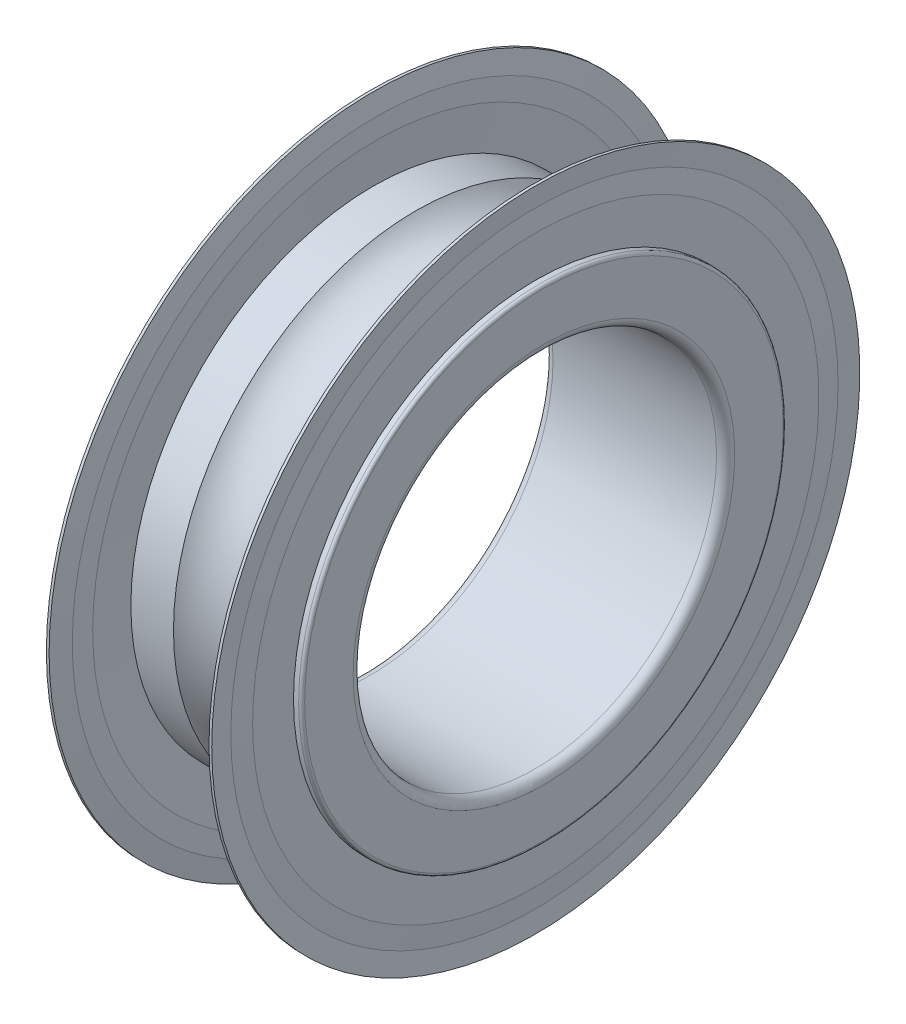
ISO-10303-21;
HEADER;
FILE_DESCRIPTION(('STEP AP214'),'2;1');
FILE_NAME('part.step','',(''),(''),'','','');
FILE_SCHEMA(('AUTOMOTIVE_DESIGN { 1 0 10303 214 1 1 1 1 }'));
ENDSEC;
DATA;
#1=APPLICATION_CONTEXT('core data for automotive mechanical design processes');
#2=APPLICATION_PROTOCOL_DEFINITION('international standard','automotive_design',2000,#1);
#3=PRODUCT_CONTEXT('',#1,'mechanical');
#4=PRODUCT('Part','Part','',(#3));
#5=PRODUCT_RELATED_PRODUCT_CATEGORY('part','',(#4));
#6=PRODUCT_DEFINITION_FORMATION('','',#4);
#7=PRODUCT_DEFINITION_CONTEXT('part definition',#1,'design');
#8=PRODUCT_DEFINITION('design','',#6,#7);
#9=PRODUCT_DEFINITION_SHAPE('','',#8);
#10=(LENGTH_UNIT() NAMED_UNIT(*) SI_UNIT(.MILLI.,.METRE.));
#11=(NAMED_UNIT(*) PLANE_ANGLE_UNIT() SI_UNIT($,.RADIAN.));
#12=(NAMED_UNIT(*) SI_UNIT($,.STERADIAN.) SOLID_ANGLE_UNIT());
#13=UNCERTAINTY_MEASURE_WITH_UNIT(LENGTH_MEASURE(1.E-05),#10,'distance_accuracy_value','');
#14=(GEOMETRIC_REPRESENTATION_CONTEXT(3) GLOBAL_UNCERTAINTY_ASSIGNED_CONTEXT((#13)) GLOBAL_UNIT_ASSIGNED_CONTEXT((#10,
#11,#12)) REPRESENTATION_CONTEXT('',''));
#15=CARTESIAN_POINT('',(0.,0.,0.));
#16=DIRECTION('',(0.,0.,1.));
#17=DIRECTION('',(1.,0.,0.));
#18=AXIS2_PLACEMENT_3D('',#15,#16,#17);
#19=CARTESIAN_POINT('',(50.,0.,0.));
#20=DIRECTION('',(-1.,0.,0.));
#21=DIRECTION('',(0.,0.,1.));
#22=AXIS2_PLACEMENT_3D('',#19,#20,#21);
#23=CYLINDRICAL_SURFACE('',#22,8.);
#24=CARTESIAN_POINT('',(4.232946166708,0.,0.));
#25=DIRECTION('',(-1.,0.,0.));
#26=DIRECTION('',(0.,0.,1.));
#27=AXIS2_PLACEMENT_3D('',#24,#25,#26);
#28=CIRCLE('',#27,8.);
#29=CARTESIAN_POINT('',(4.232946166708,0.,8.));
#30=VERTEX_POINT('',#29);
#31=EDGE_CURVE('E72',#30,#30,#28,.T.);
#32=ORIENTED_EDGE('',*,*,#31,.F.);
#33=EDGE_LOOP('',(#32));
#34=FACE_BOUND('',#33,.T.);
#35=CARTESIAN_POINT('',(5.64,0.,0.));
#36=DIRECTION('',(-1.,0.,0.));
#37=DIRECTION('',(0.,0.,1.));
#38=AXIS2_PLACEMENT_3D('',#35,#36,#37);
#39=CIRCLE('',#38,8.);
#40=CARTESIAN_POINT('',(5.64,0.,8.));
#41=VERTEX_POINT('',#40);
#42=EDGE_CURVE('E10',#41,#41,#39,.F.);
#43=ORIENTED_EDGE('',*,*,#42,.F.);
#44=EDGE_LOOP('',(#43));
#45=FACE_BOUND('',#44,.T.);
#46=ADVANCED_FACE('F31',(#34,#45),#23,.T.);
#47=CARTESIAN_POINT('',(5.9,0.,0.));
#48=DIRECTION('',(-1.,0.,0.));
#49=DIRECTION('',(0.,0.,1.));
#50=AXIS2_PLACEMENT_3D('',#47,#48,#49);
#51=CIRCLE('',#50,8.);
#52=CARTESIAN_POINT('',(5.9,0.,8.));
#53=VERTEX_POINT('',#52);
#54=EDGE_CURVE('E69',#53,#53,#51,.T.);
#55=ORIENTED_EDGE('',*,*,#54,.T.);
#56=EDGE_LOOP('',(#55));
#57=FACE_BOUND('',#56,.T.);
#58=CARTESIAN_POINT('',(5.73,0.,0.));
#59=DIRECTION('',(-1.,0.,0.));
#60=DIRECTION('',(0.,0.,1.));
#61=AXIS2_PLACEMENT_3D('',#58,#59,#60);
#62=CIRCLE('',#61,8.);
#63=CARTESIAN_POINT('',(5.73,0.,8.));
#64=VERTEX_POINT('',#63);
#65=EDGE_CURVE('E38',#64,#64,#62,.T.);
#66=ORIENTED_EDGE('',*,*,#65,.F.);
#67=EDGE_LOOP('',(#66));
#68=FACE_BOUND('',#67,.T.);
#69=ADVANCED_FACE('F148',(#57,#68),#23,.T.);
#70=CARTESIAN_POINT('',(50.,0.,0.));
#71=DIRECTION('',(-1.,0.,0.));
#72=DIRECTION('',(0.,0.,1.));
#73=AXIS2_PLACEMENT_3D('',#70,#71,#72);
#74=CYLINDRICAL_SURFACE('',#73,8.);
#75=CARTESIAN_POINT('',(0.100000000000003,0.,0.));
#76=DIRECTION('',(-1.,0.,0.));
#77=DIRECTION('',(0.,0.,1.));
#78=AXIS2_PLACEMENT_3D('',#75,#76,#77);
#79=CIRCLE('',#78,8.);
#80=CARTESIAN_POINT('',(0.100000000000003,0.,8.));
#81=VERTEX_POINT('',#80);
#82=EDGE_CURVE('E78',#81,#81,#79,.T.);
#83=ORIENTED_EDGE('',*,*,#82,.F.);
#84=EDGE_LOOP('',(#83));
#85=FACE_BOUND('',#84,.T.);
#86=CARTESIAN_POINT('',(0.269999999999999,0.,0.));
#87=DIRECTION('',(1.,0.,0.));
#88=DIRECTION('',(0.,0.,-1.));
#89=AXIS2_PLACEMENT_3D('',#86,#87,#88);
#90=CIRCLE('',#89,8.);
#91=CARTESIAN_POINT('',(0.269999999999999,0.,-8.));
#92=VERTEX_POINT('',#91);
#93=EDGE_CURVE('E42',#92,#92,#90,.T.);
#94=ORIENTED_EDGE('',*,*,#93,.F.);
#95=EDGE_LOOP('',(#94));
#96=FACE_BOUND('',#95,.T.);
#97=ADVANCED_FACE('F154',(#85,#96),#74,.T.);
#98=CARTESIAN_POINT('',(1.767053833292,0.,0.));
#99=DIRECTION('',(-1.,0.,0.));
#100=DIRECTION('',(0.,0.,1.));
#101=AXIS2_PLACEMENT_3D('',#98,#99,#100);
#102=CIRCLE('',#101,8.);
#103=CARTESIAN_POINT('',(1.767053833292,0.,8.));
#104=VERTEX_POINT('',#103);
#105=EDGE_CURVE('E75',#104,#104,#102,.T.);
#106=ORIENTED_EDGE('',*,*,#105,.T.);
#107=EDGE_LOOP('',(#106));
#108=FACE_BOUND('',#107,.T.);
#109=CARTESIAN_POINT('',(0.359999999999999,0.,0.));
#110=DIRECTION('',(1.,0.,0.));
#111=DIRECTION('',(0.,0.,-1.));
#112=AXIS2_PLACEMENT_3D('',#109,#110,#111);
#113=CIRCLE('',#112,8.);
#114=CARTESIAN_POINT('',(0.359999999999999,0.,-8.));
#115=VERTEX_POINT('',#114);
#116=EDGE_CURVE('E46',#115,#115,#113,.F.);
#117=ORIENTED_EDGE('',*,*,#116,.F.);
#118=EDGE_LOOP('',(#117));
#119=FACE_BOUND('',#118,.T.);
#120=ADVANCED_FACE('F187',(#108,#119),#74,.T.);
#121=CARTESIAN_POINT('',(0.0999999999999205,0.,0.));
#122=DIRECTION('',(-1.,0.,0.));
#123=DIRECTION('',(0.,0.,1.));
#124=AXIS2_PLACEMENT_3D('',#121,#122,#123);
#125=TOROIDAL_SURFACE('',#124,7.90000000000008,0.0999999999999201);
#126=CARTESIAN_POINT('',(0.,0.,0.));
#127=DIRECTION('',(-1.,0.,0.));
#128=DIRECTION('',(0.,0.,1.));
#129=AXIS2_PLACEMENT_3D('',#126,#127,#128);
#130=CIRCLE('',#129,7.9);
#131=CARTESIAN_POINT('',(0.,0.,7.9));
#132=VERTEX_POINT('',#131);
#133=EDGE_CURVE('E51',#132,#132,#130,.T.);
#134=ORIENTED_EDGE('',*,*,#133,.F.);
#135=EDGE_LOOP('',(#134));
#136=FACE_BOUND('',#135,.T.);
#137=ORIENTED_EDGE('',*,*,#82,.T.);
#138=EDGE_LOOP('',(#137));
#139=FACE_BOUND('',#138,.T.);
#140=ADVANCED_FACE('F33',(#136,#139),#125,.T.);
#141=CARTESIAN_POINT('',(0.,7.9,0.));
#142=DIRECTION('',(1.,0.,0.));
#143=DIRECTION('',(0.,0.,-1.));
#144=AXIS2_PLACEMENT_3D('',#141,#142,#143);
#145=PLANE('',#144);
#146=CARTESIAN_POINT('',(0.,0.,0.));
#147=DIRECTION('',(-1.,0.,0.));
#148=DIRECTION('',(0.,0.,1.));
#149=AXIS2_PLACEMENT_3D('',#146,#147,#148);
#150=CIRCLE('',#149,6.3);
#151=CARTESIAN_POINT('',(0.,0.,6.3));
#152=VERTEX_POINT('',#151);
#153=EDGE_CURVE('E54',#152,#152,#150,.T.);
#154=ORIENTED_EDGE('',*,*,#153,.F.);
#155=EDGE_LOOP('',(#154));
#156=FACE_BOUND('',#155,.T.);
#157=ORIENTED_EDGE('',*,*,#133,.T.);
#158=EDGE_LOOP('',(#157));
#159=FACE_BOUND('',#158,.T.);
#160=ADVANCED_FACE('F180',(#156,#159),#145,.F.);
#161=CARTESIAN_POINT('',(0.299999999999939,0.,0.));
#162=DIRECTION('',(-1.,0.,0.));
#163=DIRECTION('',(0.,0.,1.));
#164=AXIS2_PLACEMENT_3D('',#161,#162,#163);
#165=TOROIDAL_SURFACE('',#164,6.29999999999994,0.299999999999939);
#166=CARTESIAN_POINT('',(0.300000000000002,0.,0.));
#167=DIRECTION('',(-1.,0.,0.));
#168=DIRECTION('',(0.,0.,1.));
#169=AXIS2_PLACEMENT_3D('',#166,#167,#168);
#170=CIRCLE('',#169,6.);
#171=CARTESIAN_POINT('',(0.300000000000002,0.,6.));
#172=VERTEX_POINT('',#171);
#173=EDGE_CURVE('E57',#172,#172,#170,.T.);
#174=ORIENTED_EDGE('',*,*,#173,.F.);
#175=EDGE_LOOP('',(#174));
#176=FACE_BOUND('',#175,.T.);
#177=ORIENTED_EDGE('',*,*,#153,.T.);
#178=EDGE_LOOP('',(#177));
#179=FACE_BOUND('',#178,.T.);
#180=ADVANCED_FACE('F177',(#176,#179),#165,.T.);
#181=CARTESIAN_POINT('',(50.,0.,0.));
#182=DIRECTION('',(-1.,0.,0.));
#183=DIRECTION('',(0.,0.,1.));
#184=AXIS2_PLACEMENT_3D('',#181,#182,#183);
#185=CYLINDRICAL_SURFACE('',#184,6.);
#186=CARTESIAN_POINT('',(5.7,0.,0.));
#187=DIRECTION('',(-1.,0.,0.));
#188=DIRECTION('',(0.,0.,1.));
#189=AXIS2_PLACEMENT_3D('',#186,#187,#188);
#190=CIRCLE('',#189,6.);
#191=CARTESIAN_POINT('',(5.7,0.,6.));
#192=VERTEX_POINT('',#191);
#193=EDGE_CURVE('E60',#192,#192,#190,.T.);
#194=ORIENTED_EDGE('',*,*,#193,.F.);
#195=EDGE_LOOP('',(#194));
#196=FACE_BOUND('',#195,.T.);
#197=ORIENTED_EDGE('',*,*,#173,.T.);
#198=EDGE_LOOP('',(#197));
#199=FACE_BOUND('',#198,.T.);
#200=ADVANCED_FACE('F173',(#196,#199),#185,.F.);
#201=CARTESIAN_POINT('',(5.70000000000012,0.,0.));
#202=DIRECTION('',(-1.,0.,0.));
#203=DIRECTION('',(0.,0.,1.));
#204=AXIS2_PLACEMENT_3D('',#201,#202,#203);
#205=TOROIDAL_SURFACE('',#204,6.29999999999988,0.299999999999877);
#206=CARTESIAN_POINT('',(6.,0.,0.));
#207=DIRECTION('',(-1.,0.,0.));
#208=DIRECTION('',(0.,0.,1.));
#209=AXIS2_PLACEMENT_3D('',#206,#207,#208);
#210=CIRCLE('',#209,6.3);
#211=CARTESIAN_POINT('',(6.,0.,6.3));
#212=VERTEX_POINT('',#211);
#213=EDGE_CURVE('E63',#212,#212,#210,.T.);
#214=ORIENTED_EDGE('',*,*,#213,.F.);
#215=EDGE_LOOP('',(#214));
#216=FACE_BOUND('',#215,.T.);
#217=ORIENTED_EDGE('',*,*,#193,.T.);
#218=EDGE_LOOP('',(#217));
#219=FACE_BOUND('',#218,.T.);
#220=ADVANCED_FACE('F169',(#216,#219),#205,.T.);
#221=CARTESIAN_POINT('',(6.,6.3,0.));
#222=DIRECTION('',(-1.,0.,0.));
#223=DIRECTION('',(0.,0.,1.));
#224=AXIS2_PLACEMENT_3D('',#221,#222,#223);
#225=PLANE('',#224);
#226=CARTESIAN_POINT('',(6.,0.,0.));
#227=DIRECTION('',(-1.,0.,0.));
#228=DIRECTION('',(0.,0.,1.));
#229=AXIS2_PLACEMENT_3D('',#226,#227,#228);
#230=CIRCLE('',#229,7.9);
#231=CARTESIAN_POINT('',(6.,0.,7.9));
#232=VERTEX_POINT('',#231);
#233=EDGE_CURVE('E66',#232,#232,#230,.T.);
#234=ORIENTED_EDGE('',*,*,#233,.F.);
#235=EDGE_LOOP('',(#234));
#236=FACE_BOUND('',#235,.T.);
#237=ORIENTED_EDGE('',*,*,#213,.T.);
#238=EDGE_LOOP('',(#237));
#239=FACE_BOUND('',#238,.T.);
#240=ADVANCED_FACE('F165',(#236,#239),#225,.F.);
#241=CARTESIAN_POINT('',(5.90000000000016,0.,0.));
#242=DIRECTION('',(-1.,0.,0.));
#243=DIRECTION('',(0.,0.,1.));
#244=AXIS2_PLACEMENT_3D('',#241,#242,#243);
#245=TOROIDAL_SURFACE('',#244,7.90000000000016,0.0999999999998437);
#246=ORIENTED_EDGE('',*,*,#54,.F.);
#247=EDGE_LOOP('',(#246));
#248=FACE_BOUND('',#247,.T.);
#249=ORIENTED_EDGE('',*,*,#233,.T.);
#250=EDGE_LOOP('',(#249));
#251=FACE_BOUND('',#250,.T.);
#252=ADVANCED_FACE('F162',(#248,#251),#245,.T.);
#253=CARTESIAN_POINT('',(3.,0.,0.));
#254=DIRECTION('',(-1.,0.,0.));
#255=DIRECTION('',(0.,0.,1.));
#256=AXIS2_PLACEMENT_3D('',#253,#254,#255);
#257=TOROIDAL_SURFACE('',#256,8.99999999999996,1.58749999999996);
#258=ORIENTED_EDGE('',*,*,#105,.F.);
#259=EDGE_LOOP('',(#258));
#260=FACE_BOUND('',#259,.T.);
#261=ORIENTED_EDGE('',*,*,#31,.T.);
#262=EDGE_LOOP('',(#261));
#263=FACE_BOUND('',#262,.T.);
#264=ADVANCED_FACE('F160',(#260,#263),#257,.F.);
#265=CARTESIAN_POINT('',(50.,0.,0.));
#266=DIRECTION('',(-1.,0.,0.));
#267=DIRECTION('',(0.,0.,1.));
#268=AXIS2_PLACEMENT_3D('',#265,#266,#267);
#269=CYLINDRICAL_SURFACE('',#268,10.7);
#270=CARTESIAN_POINT('',(0.269999999999999,0.,0.));
#271=DIRECTION('',(-1.,0.,0.));
#272=DIRECTION('',(0.,0.,1.));
#273=AXIS2_PLACEMENT_3D('',#270,#271,#272);
#274=CIRCLE('',#273,10.7);
#275=CARTESIAN_POINT('',(0.269999999999999,0.,10.7));
#276=VERTEX_POINT('',#275);
#277=EDGE_CURVE('E81',#276,#276,#274,.T.);
#278=ORIENTED_EDGE('',*,*,#277,.F.);
#279=EDGE_LOOP('',(#278));
#280=FACE_BOUND('',#279,.T.);
#281=CARTESIAN_POINT('',(0.359999999999999,0.,0.));
#282=DIRECTION('',(-1.,0.,0.));
#283=DIRECTION('',(0.,0.,1.));
#284=AXIS2_PLACEMENT_3D('',#281,#282,#283);
#285=CIRCLE('',#284,10.7);
#286=CARTESIAN_POINT('',(0.359999999999999,0.,10.7));
#287=VERTEX_POINT('',#286);
#288=EDGE_CURVE('E96',#287,#287,#285,.T.);
#289=ORIENTED_EDGE('',*,*,#288,.T.);
#290=EDGE_LOOP('',(#289));
#291=FACE_BOUND('',#290,.T.);
#292=ADVANCED_FACE('F215',(#280,#291),#269,.T.);
#293=CARTESIAN_POINT('',(0.269999999999999,0.,0.));
#294=DIRECTION('',(-1.,0.,0.));
#295=DIRECTION('',(0.,0.,1.));
#296=AXIS2_PLACEMENT_3D('',#293,#294,#295);
#297=CONICAL_SURFACE('',#296,10.7,1.50422816301907);
#298=CARTESIAN_POINT('',(0.315000000000003,0.,0.));
#299=DIRECTION('',(-1.,0.,0.));
#300=DIRECTION('',(0.,0.,1.));
#301=AXIS2_PLACEMENT_3D('',#298,#299,#300);
#302=CIRCLE('',#301,10.025);
#303=CARTESIAN_POINT('',(0.315000000000003,0.,10.025));
#304=VERTEX_POINT('',#303);
#305=EDGE_CURVE('E84',#304,#304,#302,.T.);
#306=ORIENTED_EDGE('',*,*,#305,.F.);
#307=EDGE_LOOP('',(#306));
#308=FACE_BOUND('',#307,.T.);
#309=ORIENTED_EDGE('',*,*,#277,.T.);
#310=EDGE_LOOP('',(#309));
#311=FACE_BOUND('',#310,.T.);
#312=ADVANCED_FACE('F209',(#308,#311),#297,.F.);
#313=CARTESIAN_POINT('',(0.315000000000003,0.,0.));
#314=DIRECTION('',(1.,0.,0.));
#315=DIRECTION('',(0.,0.,-1.));
#316=AXIS2_PLACEMENT_3D('',#313,#314,#315);
#317=CONICAL_SURFACE('',#316,10.025,1.50422816301907);
#318=CARTESIAN_POINT('',(0.269999999999999,0.,0.));
#319=DIRECTION('',(-1.,0.,0.));
#320=DIRECTION('',(0.,0.,1.));
#321=AXIS2_PLACEMENT_3D('',#318,#319,#320);
#322=CIRCLE('',#321,9.35);
#323=CARTESIAN_POINT('',(0.269999999999999,0.,9.35));
#324=VERTEX_POINT('',#323);
#325=EDGE_CURVE('E87',#324,#324,#322,.T.);
#326=ORIENTED_EDGE('',*,*,#325,.F.);
#327=EDGE_LOOP('',(#326));
#328=FACE_BOUND('',#327,.T.);
#329=ORIENTED_EDGE('',*,*,#305,.T.);
#330=EDGE_LOOP('',(#329));
#331=FACE_BOUND('',#330,.T.);
#332=ADVANCED_FACE('F203',(#328,#331),#317,.T.);
#333=CARTESIAN_POINT('',(0.27,9.35,0.));
#334=DIRECTION('',(1.,0.,0.));
#335=DIRECTION('',(0.,0.,-1.));
#336=AXIS2_PLACEMENT_3D('',#333,#334,#335);
#337=PLANE('',#336);
#338=ORIENTED_EDGE('',*,*,#93,.T.);
#339=EDGE_LOOP('',(#338));
#340=FACE_BOUND('',#339,.T.);
#341=ORIENTED_EDGE('',*,*,#325,.T.);
#342=EDGE_LOOP('',(#341));
#343=FACE_BOUND('',#342,.T.);
#344=ADVANCED_FACE('F199',(#340,#343),#337,.F.);
#345=CARTESIAN_POINT('',(0.359999999999999,0.,0.));
#346=DIRECTION('',(1.,0.,0.));
#347=DIRECTION('',(0.,0.,-1.));
#348=AXIS2_PLACEMENT_3D('',#345,#346,#347);
#349=CONICAL_SURFACE('',#348,8.,1.50422816301907);
#350=CARTESIAN_POINT('',(0.449999999999999,0.,0.));
#351=DIRECTION('',(-1.,0.,0.));
#352=DIRECTION('',(0.,0.,1.));
#353=AXIS2_PLACEMENT_3D('',#350,#351,#352);
#354=CIRCLE('',#353,9.35);
#355=CARTESIAN_POINT('',(0.449999999999999,0.,9.35));
#356=VERTEX_POINT('',#355);
#357=EDGE_CURVE('E90',#356,#356,#354,.T.);
#358=ORIENTED_EDGE('',*,*,#357,.F.);
#359=EDGE_LOOP('',(#358));
#360=FACE_BOUND('',#359,.T.);
#361=ORIENTED_EDGE('',*,*,#116,.T.);
#362=EDGE_LOOP('',(#361));
#363=FACE_BOUND('',#362,.T.);
#364=ADVANCED_FACE('F202',(#360,#363),#349,.F.);
#365=CARTESIAN_POINT('',(0.45,9.35,0.));
#366=DIRECTION('',(-1.,0.,0.));
#367=DIRECTION('',(0.,0.,1.));
#368=AXIS2_PLACEMENT_3D('',#365,#366,#367);
#369=PLANE('',#368);
#370=CARTESIAN_POINT('',(0.449999999999999,0.,0.));
#371=DIRECTION('',(-1.,0.,0.));
#372=DIRECTION('',(0.,0.,1.));
#373=AXIS2_PLACEMENT_3D('',#370,#371,#372);
#374=CIRCLE('',#373,10.025);
#375=CARTESIAN_POINT('',(0.449999999999999,0.,10.025));
#376=VERTEX_POINT('',#375);
#377=EDGE_CURVE('E93',#376,#376,#374,.T.);
#378=ORIENTED_EDGE('',*,*,#377,.F.);
#379=EDGE_LOOP('',(#378));
#380=FACE_BOUND('',#379,.T.);
#381=ORIENTED_EDGE('',*,*,#357,.T.);
#382=EDGE_LOOP('',(#381));
#383=FACE_BOUND('',#382,.T.);
#384=ADVANCED_FACE('F227',(#380,#383),#369,.F.);
#385=CARTESIAN_POINT('',(0.449999999999999,0.,0.));
#386=DIRECTION('',(-1.,0.,0.));
#387=DIRECTION('',(0.,0.,1.));
#388=AXIS2_PLACEMENT_3D('',#385,#386,#387);
#389=CONICAL_SURFACE('',#388,10.025,1.43824479449822);
#390=ORIENTED_EDGE('',*,*,#288,.F.);
#391=EDGE_LOOP('',(#390));
#392=FACE_BOUND('',#391,.T.);
#393=ORIENTED_EDGE('',*,*,#377,.T.);
#394=EDGE_LOOP('',(#393));
#395=FACE_BOUND('',#394,.T.);
#396=ADVANCED_FACE('F224',(#392,#395),#389,.T.);
#397=CARTESIAN_POINT('',(5.64,0.,0.));
#398=DIRECTION('',(1.,0.,0.));
#399=DIRECTION('',(0.,0.,-1.));
#400=AXIS2_PLACEMENT_3D('',#397,#398,#399);
#401=CONICAL_SURFACE('',#400,10.7,1.43824479449822);
#402=CARTESIAN_POINT('',(5.55,0.,0.));
#403=DIRECTION('',(-1.,0.,0.));
#404=DIRECTION('',(0.,0.,1.));
#405=AXIS2_PLACEMENT_3D('',#402,#403,#404);
#406=CIRCLE('',#405,10.025);
#407=CARTESIAN_POINT('',(5.55,0.,10.025));
#408=VERTEX_POINT('',#407);
#409=EDGE_CURVE('E99',#408,#408,#406,.T.);
#410=ORIENTED_EDGE('',*,*,#409,.F.);
#411=EDGE_LOOP('',(#410));
#412=FACE_BOUND('',#411,.T.);
#413=CARTESIAN_POINT('',(5.64,0.,0.));
#414=DIRECTION('',(-1.,0.,0.));
#415=DIRECTION('',(0.,0.,1.));
#416=AXIS2_PLACEMENT_3D('',#413,#414,#415);
#417=CIRCLE('',#416,10.7);
#418=CARTESIAN_POINT('',(5.64,0.,10.7));
#419=VERTEX_POINT('',#418);
#420=EDGE_CURVE('E114',#419,#419,#417,.T.);
#421=ORIENTED_EDGE('',*,*,#420,.T.);
#422=EDGE_LOOP('',(#421));
#423=FACE_BOUND('',#422,.T.);
#424=ADVANCED_FACE('F118',(#412,#423),#401,.T.);
#425=CARTESIAN_POINT('',(5.55,10.025,0.));
#426=DIRECTION('',(1.,0.,0.));
#427=DIRECTION('',(0.,0.,-1.));
#428=AXIS2_PLACEMENT_3D('',#425,#426,#427);
#429=PLANE('',#428);
#430=CARTESIAN_POINT('',(5.55,0.,0.));
#431=DIRECTION('',(-1.,0.,0.));
#432=DIRECTION('',(0.,0.,1.));
#433=AXIS2_PLACEMENT_3D('',#430,#431,#432);
#434=CIRCLE('',#433,9.35);
#435=CARTESIAN_POINT('',(5.55,0.,9.35));
#436=VERTEX_POINT('',#435);
#437=EDGE_CURVE('E102',#436,#436,#434,.T.);
#438=ORIENTED_EDGE('',*,*,#437,.F.);
#439=EDGE_LOOP('',(#438));
#440=FACE_BOUND('',#439,.T.);
#441=ORIENTED_EDGE('',*,*,#409,.T.);
#442=EDGE_LOOP('',(#441));
#443=FACE_BOUND('',#442,.T.);
#444=ADVANCED_FACE('F145',(#440,#443),#429,.F.);
#445=CARTESIAN_POINT('',(5.55,0.,0.));
#446=DIRECTION('',(-1.,0.,0.));
#447=DIRECTION('',(0.,0.,1.));
#448=AXIS2_PLACEMENT_3D('',#445,#446,#447);
#449=CONICAL_SURFACE('',#448,9.35,1.50422816301907);
#450=ORIENTED_EDGE('',*,*,#42,.T.);
#451=EDGE_LOOP('',(#450));
#452=FACE_BOUND('',#451,.T.);
#453=ORIENTED_EDGE('',*,*,#437,.T.);
#454=EDGE_LOOP('',(#453));
#455=FACE_BOUND('',#454,.T.);
#456=ADVANCED_FACE('F140',(#452,#455),#449,.F.);
#457=CARTESIAN_POINT('',(5.73,8.,0.));
#458=DIRECTION('',(-1.,0.,0.));
#459=DIRECTION('',(0.,0.,1.));
#460=AXIS2_PLACEMENT_3D('',#457,#458,#459);
#461=PLANE('',#460);
#462=CARTESIAN_POINT('',(5.73,0.,0.));
#463=DIRECTION('',(-1.,0.,0.));
#464=DIRECTION('',(0.,0.,1.));
#465=AXIS2_PLACEMENT_3D('',#462,#463,#464);
#466=CIRCLE('',#465,9.35);
#467=CARTESIAN_POINT('',(5.73,0.,9.35));
#468=VERTEX_POINT('',#467);
#469=EDGE_CURVE('E105',#468,#468,#466,.T.);
#470=ORIENTED_EDGE('',*,*,#469,.F.);
#471=EDGE_LOOP('',(#470));
#472=FACE_BOUND('',#471,.T.);
#473=ORIENTED_EDGE('',*,*,#65,.T.);
#474=EDGE_LOOP('',(#473));
#475=FACE_BOUND('',#474,.T.);
#476=ADVANCED_FACE('F135',(#472,#475),#461,.F.);
#477=CARTESIAN_POINT('',(5.73,0.,0.));
#478=DIRECTION('',(-1.,0.,0.));
#479=DIRECTION('',(0.,0.,1.));
#480=AXIS2_PLACEMENT_3D('',#477,#478,#479);
#481=CONICAL_SURFACE('',#480,9.35,1.50422816301908);
#482=CARTESIAN_POINT('',(5.685,0.,0.));
#483=DIRECTION('',(-1.,0.,0.));
#484=DIRECTION('',(0.,0.,1.));
#485=AXIS2_PLACEMENT_3D('',#482,#483,#484);
#486=CIRCLE('',#485,10.025);
#487=CARTESIAN_POINT('',(5.685,0.,10.025));
#488=VERTEX_POINT('',#487);
#489=EDGE_CURVE('E108',#488,#488,#486,.T.);
#490=ORIENTED_EDGE('',*,*,#489,.F.);
#491=EDGE_LOOP('',(#490));
#492=FACE_BOUND('',#491,.T.);
#493=ORIENTED_EDGE('',*,*,#469,.T.);
#494=EDGE_LOOP('',(#493));
#495=FACE_BOUND('',#494,.T.);
#496=ADVANCED_FACE('F129',(#492,#495),#481,.T.);
#497=CARTESIAN_POINT('',(5.685,0.,0.));
#498=DIRECTION('',(1.,0.,0.));
#499=DIRECTION('',(0.,0.,-1.));
#500=AXIS2_PLACEMENT_3D('',#497,#498,#499);
#501=CONICAL_SURFACE('',#500,10.025,1.50422816301908);
#502=CARTESIAN_POINT('',(5.73,0.,0.));
#503=DIRECTION('',(-1.,0.,0.));
#504=DIRECTION('',(0.,0.,1.));
#505=AXIS2_PLACEMENT_3D('',#502,#503,#504);
#506=CIRCLE('',#505,10.7);
#507=CARTESIAN_POINT('',(5.73,0.,10.7));
#508=VERTEX_POINT('',#507);
#509=EDGE_CURVE('E111',#508,#508,#506,.T.);
#510=ORIENTED_EDGE('',*,*,#509,.F.);
#511=EDGE_LOOP('',(#510));
#512=FACE_BOUND('',#511,.T.);
#513=ORIENTED_EDGE('',*,*,#489,.T.);
#514=EDGE_LOOP('',(#513));
#515=FACE_BOUND('',#514,.T.);
#516=ADVANCED_FACE('F123',(#512,#515),#501,.F.);
#517=CARTESIAN_POINT('',(50.,0.,0.));
#518=DIRECTION('',(-1.,0.,0.));
#519=DIRECTION('',(0.,0.,1.));
#520=AXIS2_PLACEMENT_3D('',#517,#518,#519);
#521=CYLINDRICAL_SURFACE('',#520,10.7);
#522=ORIENTED_EDGE('',*,*,#420,.F.);
#523=EDGE_LOOP('',(#522));
#524=FACE_BOUND('',#523,.T.);
#525=ORIENTED_EDGE('',*,*,#509,.T.);
#526=EDGE_LOOP('',(#525));
#527=FACE_BOUND('',#526,.T.);
#528=ADVANCED_FACE('F120',(#524,#527),#521,.T.);
#529=CLOSED_SHELL('',(#46,#69,#97,#120,#140,#160,#180,#200,#220,#240,#252,#264,#292,#312,#332,
#344,#364,#384,#396,#424,#444,#456,#476,#496,#516,#528));
#530=MANIFOLD_SOLID_BREP('B2',#529);
#531=ADVANCED_BREP_SHAPE_REPRESENTATION('',(#18,#530),#14);
#532=SHAPE_DEFINITION_REPRESENTATION(#9,#531);
ENDSEC;
END-ISO-10303-21;
